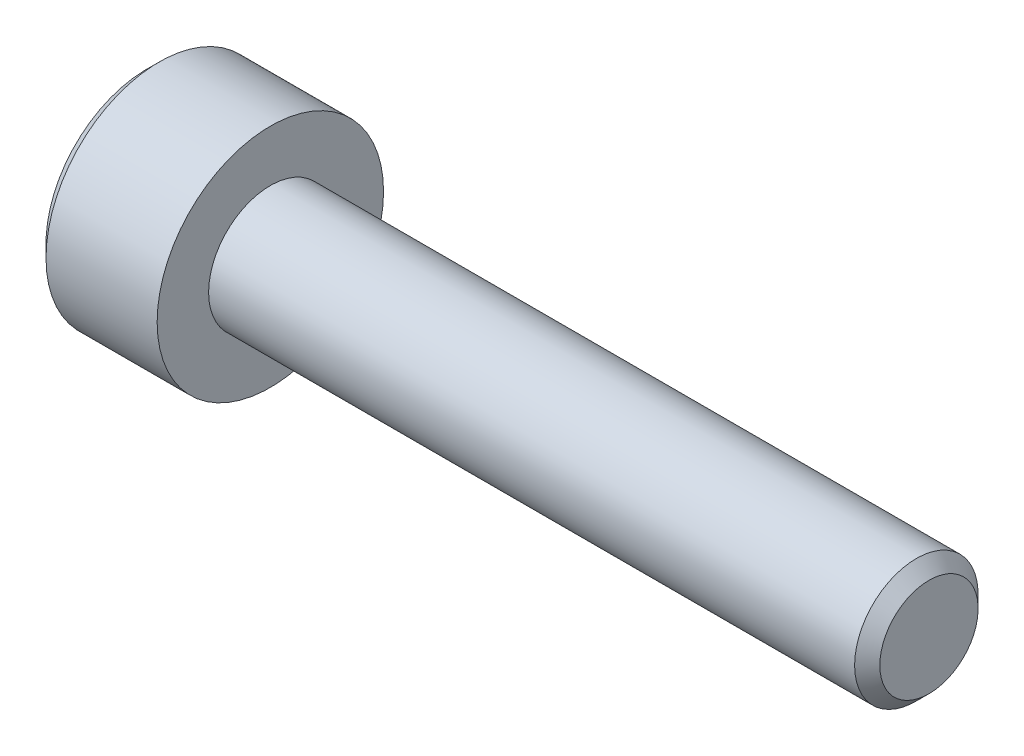
ISO-10303-21;
HEADER;
FILE_DESCRIPTION(('STEP AP214'),'2;1');
FILE_NAME('part.step','',(''),(''),'','','');
FILE_SCHEMA(('AUTOMOTIVE_DESIGN { 1 0 10303 214 1 1 1 1 }'));
ENDSEC;
DATA;
#1=APPLICATION_CONTEXT('core data for automotive mechanical design processes');
#2=APPLICATION_PROTOCOL_DEFINITION('international standard','automotive_design',2000,#1);
#3=PRODUCT_CONTEXT('',#1,'mechanical');
#4=PRODUCT('Part','Part','',(#3));
#5=PRODUCT_RELATED_PRODUCT_CATEGORY('part','',(#4));
#6=PRODUCT_DEFINITION_FORMATION('','',#4);
#7=PRODUCT_DEFINITION_CONTEXT('part definition',#1,'design');
#8=PRODUCT_DEFINITION('design','',#6,#7);
#9=PRODUCT_DEFINITION_SHAPE('','',#8);
#10=(LENGTH_UNIT() NAMED_UNIT(*) SI_UNIT(.MILLI.,.METRE.));
#11=(NAMED_UNIT(*) PLANE_ANGLE_UNIT() SI_UNIT($,.RADIAN.));
#12=(NAMED_UNIT(*) SI_UNIT($,.STERADIAN.) SOLID_ANGLE_UNIT());
#13=UNCERTAINTY_MEASURE_WITH_UNIT(LENGTH_MEASURE(1.E-05),#10,'distance_accuracy_value','');
#14=(GEOMETRIC_REPRESENTATION_CONTEXT(3) GLOBAL_UNCERTAINTY_ASSIGNED_CONTEXT((#13)) GLOBAL_UNIT_ASSIGNED_CONTEXT((#10,
#11,#12)) REPRESENTATION_CONTEXT('',''));
#15=CARTESIAN_POINT('',(0.,0.,0.));
#16=DIRECTION('',(0.,0.,1.));
#17=DIRECTION('',(1.,0.,0.));
#18=AXIS2_PLACEMENT_3D('',#15,#16,#17);
#19=CARTESIAN_POINT('',(-1.49999999999295,0.,0.));
#20=DIRECTION('',(-1.,0.,0.));
#21=DIRECTION('',(0.,0.,1.));
#22=AXIS2_PLACEMENT_3D('',#19,#20,#21);
#23=CONICAL_SURFACE('',#22,1.24999999997044,1.30899693901632);
#24=CARTESIAN_POINT('',(-1.16506350948953,0.,0.));
#25=VERTEX_POINT('',#24);
#26=VERTEX_LOOP('',#25);
#27=FACE_BOUND('',#26,.T.);
#28=CARTESIAN_POINT('',(-1.49999999999295,0.,0.));
#29=DIRECTION('',(-1.,0.,0.));
#30=DIRECTION('',(0.,0.,1.));
#31=AXIS2_PLACEMENT_3D('',#28,#29,#30);
#32=CIRCLE('',#31,1.24999999997044);
#33=CARTESIAN_POINT('',(-1.49999999999648,1.08253175471775,-0.624999999992609));
#34=VERTEX_POINT('',#33);
#35=CARTESIAN_POINT('',(-1.49999999999648,0.,-1.24999999998522));
#36=VERTEX_POINT('',#35);
#37=EDGE_CURVE('E152',#34,#36,#32,.T.);
#38=ORIENTED_EDGE('',*,*,#37,.T.);
#39=CARTESIAN_POINT('',(-1.49999999999295,0.,0.));
#40=DIRECTION('',(-1.,0.,0.));
#41=DIRECTION('',(0.,0.,1.));
#42=AXIS2_PLACEMENT_3D('',#39,#40,#41);
#43=CIRCLE('',#42,1.24999999997044);
#44=CARTESIAN_POINT('',(-1.49999999999648,-1.08253175471775,-0.624999999992609));
#45=VERTEX_POINT('',#44);
#46=EDGE_CURVE('E136',#36,#45,#43,.T.);
#47=ORIENTED_EDGE('',*,*,#46,.T.);
#48=CARTESIAN_POINT('',(-1.49999999999295,0.,0.));
#49=DIRECTION('',(-1.,0.,0.));
#50=DIRECTION('',(0.,0.,1.));
#51=AXIS2_PLACEMENT_3D('',#48,#49,#50);
#52=CIRCLE('',#51,1.24999999997044);
#53=CARTESIAN_POINT('',(-1.49999999999648,-1.08253175471775,0.624999999992609));
#54=VERTEX_POINT('',#53);
#55=EDGE_CURVE('E89',#45,#54,#52,.T.);
#56=ORIENTED_EDGE('',*,*,#55,.T.);
#57=CARTESIAN_POINT('',(-1.49999999999295,0.,0.));
#58=DIRECTION('',(-1.,0.,0.));
#59=DIRECTION('',(0.,0.,1.));
#60=AXIS2_PLACEMENT_3D('',#57,#58,#59);
#61=CIRCLE('',#60,1.24999999997044);
#62=CARTESIAN_POINT('',(-1.49999999999648,0.,1.24999999998522));
#63=VERTEX_POINT('',#62);
#64=EDGE_CURVE('E20',#54,#63,#61,.T.);
#65=ORIENTED_EDGE('',*,*,#64,.T.);
#66=CARTESIAN_POINT('',(-1.49999999999295,0.,0.));
#67=DIRECTION('',(-1.,0.,0.));
#68=DIRECTION('',(0.,0.,1.));
#69=AXIS2_PLACEMENT_3D('',#66,#67,#68);
#70=CIRCLE('',#69,1.24999999997044);
#71=CARTESIAN_POINT('',(-1.49999999999648,1.08253175471775,0.624999999992609));
#72=VERTEX_POINT('',#71);
#73=EDGE_CURVE('E92',#63,#72,#70,.T.);
#74=ORIENTED_EDGE('',*,*,#73,.T.);
#75=CARTESIAN_POINT('',(-1.49999999999295,0.,0.));
#76=DIRECTION('',(-1.,0.,0.));
#77=DIRECTION('',(0.,0.,1.));
#78=AXIS2_PLACEMENT_3D('',#75,#76,#77);
#79=CIRCLE('',#78,1.24999999997044);
#80=EDGE_CURVE('E106',#72,#34,#79,.T.);
#81=ORIENTED_EDGE('',*,*,#80,.T.);
#82=EDGE_LOOP('',(#38,#47,#56,#65,#74,#81));
#83=FACE_BOUND('',#82,.T.);
#84=ADVANCED_FACE('F17',(#27,#83),#23,.F.);
#85=CARTESIAN_POINT('',(-1.5,0.,0.));
#86=DIRECTION('',(1.,0.,0.));
#87=DIRECTION('',(0.,0.,-1.));
#88=AXIS2_PLACEMENT_3D('',#85,#86,#87);
#89=PLANE('',#88);
#90=DIRECTION('',(0.,0.5,0.866025403784439));
#91=VECTOR('',#90,1.);
#92=CARTESIAN_POINT('',(-1.5,-0.721687836487032,1.25));
#93=LINE('',#92,#91);
#94=CARTESIAN_POINT('',(-1.5,-0.721687836487032,1.25));
#95=VERTEX_POINT('',#94);
#96=EDGE_CURVE('E111',#95,#54,#93,.F.);
#97=ORIENTED_EDGE('',*,*,#96,.F.);
#98=DIRECTION('',(0.,1.,0.));
#99=VECTOR('',#98,1.);
#100=CARTESIAN_POINT('',(-1.5,0.721687836487032,1.25));
#101=LINE('',#100,#99);
#102=EDGE_CURVE('E108',#63,#95,#101,.F.);
#103=ORIENTED_EDGE('',*,*,#102,.F.);
#104=ORIENTED_EDGE('',*,*,#64,.F.);
#105=EDGE_LOOP('',(#97,#103,#104));
#106=FACE_BOUND('',#105,.T.);
#107=ADVANCED_FACE('F109',(#106),#89,.F.);
#108=CARTESIAN_POINT('',(-1.5,0.,0.));
#109=DIRECTION('',(1.,0.,0.));
#110=DIRECTION('',(0.,0.,-1.));
#111=AXIS2_PLACEMENT_3D('',#108,#109,#110);
#112=PLANE('',#111);
#113=DIRECTION('',(0.,1.,0.));
#114=VECTOR('',#113,1.);
#115=CARTESIAN_POINT('',(-1.5,0.721687836487032,1.25));
#116=LINE('',#115,#114);
#117=CARTESIAN_POINT('',(-1.5,0.721687836487029,1.25));
#118=VERTEX_POINT('',#117);
#119=EDGE_CURVE('E101',#118,#63,#116,.F.);
#120=ORIENTED_EDGE('',*,*,#119,.F.);
#121=DIRECTION('',(0.,0.5,-0.866025403784439));
#122=VECTOR('',#121,1.);
#123=CARTESIAN_POINT('',(-1.5,1.44337567297406,0.));
#124=LINE('',#123,#122);
#125=EDGE_CURVE('E104',#72,#118,#124,.F.);
#126=ORIENTED_EDGE('',*,*,#125,.F.);
#127=ORIENTED_EDGE('',*,*,#73,.F.);
#128=EDGE_LOOP('',(#120,#126,#127));
#129=FACE_BOUND('',#128,.T.);
#130=ADVANCED_FACE('F99',(#129),#112,.F.);
#131=CARTESIAN_POINT('',(-1.5,0.,0.));
#132=DIRECTION('',(1.,0.,0.));
#133=DIRECTION('',(0.,0.,-1.));
#134=AXIS2_PLACEMENT_3D('',#131,#132,#133);
#135=PLANE('',#134);
#136=ORIENTED_EDGE('',*,*,#80,.F.);
#137=DIRECTION('',(0.,0.5,-0.866025403784439));
#138=VECTOR('',#137,1.);
#139=CARTESIAN_POINT('',(-1.5,1.44337567297406,0.));
#140=LINE('',#139,#138);
#141=CARTESIAN_POINT('',(-1.5,1.44337567297406,0.));
#142=VERTEX_POINT('',#141);
#143=EDGE_CURVE('E132',#142,#72,#140,.F.);
#144=ORIENTED_EDGE('',*,*,#143,.F.);
#145=DIRECTION('',(0.,-0.5,-0.866025403784439));
#146=VECTOR('',#145,1.);
#147=CARTESIAN_POINT('',(-1.5,0.721687836487032,-1.25));
#148=LINE('',#147,#146);
#149=EDGE_CURVE('E168',#34,#142,#148,.F.);
#150=ORIENTED_EDGE('',*,*,#149,.F.);
#151=EDGE_LOOP('',(#136,#144,#150));
#152=FACE_BOUND('',#151,.T.);
#153=ADVANCED_FACE('F169',(#152),#135,.F.);
#154=CARTESIAN_POINT('',(-1.5,0.,0.));
#155=DIRECTION('',(1.,0.,0.));
#156=DIRECTION('',(0.,0.,-1.));
#157=AXIS2_PLACEMENT_3D('',#154,#155,#156);
#158=PLANE('',#157);
#159=DIRECTION('',(0.,-0.5,-0.866025403784439));
#160=VECTOR('',#159,1.);
#161=CARTESIAN_POINT('',(-1.5,0.721687836487032,-1.25));
#162=LINE('',#161,#160);
#163=CARTESIAN_POINT('',(-1.5,0.721687836487032,-1.25));
#164=VERTEX_POINT('',#163);
#165=EDGE_CURVE('E162',#164,#34,#162,.F.);
#166=ORIENTED_EDGE('',*,*,#165,.F.);
#167=DIRECTION('',(0.,1.,0.));
#168=VECTOR('',#167,1.);
#169=CARTESIAN_POINT('',(-1.5,-0.721687836487032,-1.25));
#170=LINE('',#169,#168);
#171=EDGE_CURVE('E165',#36,#164,#170,.T.);
#172=ORIENTED_EDGE('',*,*,#171,.F.);
#173=ORIENTED_EDGE('',*,*,#37,.F.);
#174=EDGE_LOOP('',(#166,#172,#173));
#175=FACE_BOUND('',#174,.T.);
#176=ADVANCED_FACE('F160',(#175),#158,.F.);
#177=CARTESIAN_POINT('',(-1.5,0.,0.));
#178=DIRECTION('',(1.,0.,0.));
#179=DIRECTION('',(0.,0.,-1.));
#180=AXIS2_PLACEMENT_3D('',#177,#178,#179);
#181=PLANE('',#180);
#182=DIRECTION('',(0.,-0.5,0.866025403784439));
#183=VECTOR('',#182,1.);
#184=CARTESIAN_POINT('',(-1.5,-1.44337567297406,0.));
#185=LINE('',#184,#183);
#186=CARTESIAN_POINT('',(-1.5,-1.44337567297406,0.));
#187=VERTEX_POINT('',#186);
#188=EDGE_CURVE('E214',#187,#45,#185,.F.);
#189=ORIENTED_EDGE('',*,*,#188,.F.);
#190=DIRECTION('',(0.,0.5,0.866025403784439));
#191=VECTOR('',#190,1.);
#192=CARTESIAN_POINT('',(-1.5,-0.721687836487032,1.25));
#193=LINE('',#192,#191);
#194=EDGE_CURVE('E120',#54,#187,#193,.F.);
#195=ORIENTED_EDGE('',*,*,#194,.F.);
#196=ORIENTED_EDGE('',*,*,#55,.F.);
#197=EDGE_LOOP('',(#189,#195,#196));
#198=FACE_BOUND('',#197,.T.);
#199=ADVANCED_FACE('F253',(#198),#181,.F.);
#200=CARTESIAN_POINT('',(-1.5,0.,0.));
#201=DIRECTION('',(1.,0.,0.));
#202=DIRECTION('',(0.,0.,-1.));
#203=AXIS2_PLACEMENT_3D('',#200,#201,#202);
#204=PLANE('',#203);
#205=DIRECTION('',(0.,1.,0.));
#206=VECTOR('',#205,1.);
#207=CARTESIAN_POINT('',(-1.5,-0.721687836487032,-1.25));
#208=LINE('',#207,#206);
#209=CARTESIAN_POINT('',(-1.5,-0.721687836487029,-1.25));
#210=VERTEX_POINT('',#209);
#211=EDGE_CURVE('E187',#210,#36,#208,.T.);
#212=ORIENTED_EDGE('',*,*,#211,.F.);
#213=DIRECTION('',(0.,-0.5,0.866025403784439));
#214=VECTOR('',#213,1.);
#215=CARTESIAN_POINT('',(-1.5,-1.44337567297406,0.));
#216=LINE('',#215,#214);
#217=EDGE_CURVE('E217',#45,#210,#216,.F.);
#218=ORIENTED_EDGE('',*,*,#217,.F.);
#219=ORIENTED_EDGE('',*,*,#46,.F.);
#220=EDGE_LOOP('',(#212,#218,#219));
#221=FACE_BOUND('',#220,.T.);
#222=ADVANCED_FACE('F250',(#221),#204,.F.);
#223=CARTESIAN_POINT('',(-1.5,-0.721687836487032,1.25));
#224=DIRECTION('',(0.,0.866025403784439,-0.5));
#225=DIRECTION('',(0.,0.5,0.866025403784439));
#226=AXIS2_PLACEMENT_3D('',#223,#224,#225);
#227=PLANE('',#226);
#228=ORIENTED_EDGE('',*,*,#194,.T.);
#229=DIRECTION('',(1.,0.,0.));
#230=VECTOR('',#229,1.);
#231=CARTESIAN_POINT('',(-1.5,-1.44337567297406,0.));
#232=LINE('',#231,#230);
#233=CARTESIAN_POINT('',(-3.,-1.44337567297406,0.));
#234=VERTEX_POINT('',#233);
#235=EDGE_CURVE('E218',#234,#187,#232,.T.);
#236=ORIENTED_EDGE('',*,*,#235,.F.);
#237=DIRECTION('',(0.,0.499999999999998,0.86602540378444));
#238=VECTOR('',#237,1.);
#239=CARTESIAN_POINT('',(-3.,-1.44337567297406,0.));
#240=LINE('',#239,#238);
#241=CARTESIAN_POINT('',(-3.,-0.721687836487032,1.25));
#242=VERTEX_POINT('',#241);
#243=EDGE_CURVE('E213',#234,#242,#240,.T.);
#244=ORIENTED_EDGE('',*,*,#243,.T.);
#245=DIRECTION('',(-1.,0.,0.));
#246=VECTOR('',#245,1.);
#247=CARTESIAN_POINT('',(-1.5,-0.721687836487032,1.25));
#248=LINE('',#247,#246);
#249=EDGE_CURVE('E115',#95,#242,#248,.T.);
#250=ORIENTED_EDGE('',*,*,#249,.F.);
#251=ORIENTED_EDGE('',*,*,#96,.T.);
#252=EDGE_LOOP('',(#228,#236,#244,#250,#251));
#253=FACE_BOUND('',#252,.T.);
#254=ADVANCED_FACE('F255',(#253),#227,.T.);
#255=CARTESIAN_POINT('',(-1.5,0.721687836487032,1.25));
#256=DIRECTION('',(0.,0.,-1.));
#257=DIRECTION('',(-1.,0.,0.));
#258=AXIS2_PLACEMENT_3D('',#255,#256,#257);
#259=PLANE('',#258);
#260=ORIENTED_EDGE('',*,*,#102,.T.);
#261=ORIENTED_EDGE('',*,*,#249,.T.);
#262=DIRECTION('',(0.,1.,0.));
#263=VECTOR('',#262,1.);
#264=CARTESIAN_POINT('',(-3.,0.,1.25));
#265=LINE('',#264,#263);
#266=CARTESIAN_POINT('',(-3.,0.721687836487031,1.25));
#267=VERTEX_POINT('',#266);
#268=EDGE_CURVE('E208',#242,#267,#265,.T.);
#269=ORIENTED_EDGE('',*,*,#268,.T.);
#270=DIRECTION('',(1.,0.,0.));
#271=VECTOR('',#270,1.);
#272=CARTESIAN_POINT('',(-1.5,0.721687836487029,1.25));
#273=LINE('',#272,#271);
#274=EDGE_CURVE('E119',#118,#267,#273,.F.);
#275=ORIENTED_EDGE('',*,*,#274,.F.);
#276=ORIENTED_EDGE('',*,*,#119,.T.);
#277=EDGE_LOOP('',(#260,#261,#269,#275,#276));
#278=FACE_BOUND('',#277,.T.);
#279=ADVANCED_FACE('F117',(#278),#259,.T.);
#280=CARTESIAN_POINT('',(-1.5,1.44337567297406,0.));
#281=DIRECTION('',(0.,-0.866025403784439,-0.5));
#282=DIRECTION('',(0.,0.5,-0.866025403784439));
#283=AXIS2_PLACEMENT_3D('',#280,#281,#282);
#284=PLANE('',#283);
#285=ORIENTED_EDGE('',*,*,#125,.T.);
#286=ORIENTED_EDGE('',*,*,#274,.T.);
#287=DIRECTION('',(0.,0.499999999999998,-0.86602540378444));
#288=VECTOR('',#287,1.);
#289=CARTESIAN_POINT('',(-3.,0.721687836487032,1.25));
#290=LINE('',#289,#288);
#291=CARTESIAN_POINT('',(-3.,1.44337567297406,0.));
#292=VERTEX_POINT('',#291);
#293=EDGE_CURVE('E198',#267,#292,#290,.T.);
#294=ORIENTED_EDGE('',*,*,#293,.T.);
#295=DIRECTION('',(1.,0.,0.));
#296=VECTOR('',#295,1.);
#297=CARTESIAN_POINT('',(-1.5,1.44337567297406,0.));
#298=LINE('',#297,#296);
#299=EDGE_CURVE('E173',#142,#292,#298,.F.);
#300=ORIENTED_EDGE('',*,*,#299,.F.);
#301=ORIENTED_EDGE('',*,*,#143,.T.);
#302=EDGE_LOOP('',(#285,#286,#294,#300,#301));
#303=FACE_BOUND('',#302,.T.);
#304=ADVANCED_FACE('F196',(#303),#284,.T.);
#305=CARTESIAN_POINT('',(-1.5,0.721687836487032,-1.25));
#306=DIRECTION('',(0.,-0.866025403784439,0.5));
#307=DIRECTION('',(0.,-0.5,-0.866025403784439));
#308=AXIS2_PLACEMENT_3D('',#305,#306,#307);
#309=PLANE('',#308);
#310=ORIENTED_EDGE('',*,*,#149,.T.);
#311=ORIENTED_EDGE('',*,*,#299,.T.);
#312=DIRECTION('',(0.,-0.499999999999998,-0.86602540378444));
#313=VECTOR('',#312,1.);
#314=CARTESIAN_POINT('',(-3.,1.44337567297406,0.));
#315=LINE('',#314,#313);
#316=CARTESIAN_POINT('',(-3.,0.721687836487032,-1.25));
#317=VERTEX_POINT('',#316);
#318=EDGE_CURVE('E200',#292,#317,#315,.T.);
#319=ORIENTED_EDGE('',*,*,#318,.T.);
#320=DIRECTION('',(1.,0.,0.));
#321=VECTOR('',#320,1.);
#322=CARTESIAN_POINT('',(-1.5,0.721687836487032,-1.25));
#323=LINE('',#322,#321);
#324=EDGE_CURVE('E176',#164,#317,#323,.F.);
#325=ORIENTED_EDGE('',*,*,#324,.F.);
#326=ORIENTED_EDGE('',*,*,#165,.T.);
#327=EDGE_LOOP('',(#310,#311,#319,#325,#326));
#328=FACE_BOUND('',#327,.T.);
#329=ADVANCED_FACE('F175',(#328),#309,.T.);
#330=CARTESIAN_POINT('',(-1.5,-0.721687836487032,-1.25));
#331=DIRECTION('',(0.,0.,1.));
#332=DIRECTION('',(1.,0.,0.));
#333=AXIS2_PLACEMENT_3D('',#330,#331,#332);
#334=PLANE('',#333);
#335=ORIENTED_EDGE('',*,*,#171,.T.);
#336=ORIENTED_EDGE('',*,*,#324,.T.);
#337=DIRECTION('',(0.,1.,0.));
#338=VECTOR('',#337,1.);
#339=CARTESIAN_POINT('',(-3.,0.,-1.25));
#340=LINE('',#339,#338);
#341=CARTESIAN_POINT('',(-3.,-0.721687836487031,-1.25));
#342=VERTEX_POINT('',#341);
#343=EDGE_CURVE('E35',#317,#342,#340,.F.);
#344=ORIENTED_EDGE('',*,*,#343,.T.);
#345=DIRECTION('',(1.,0.,0.));
#346=VECTOR('',#345,1.);
#347=CARTESIAN_POINT('',(-1.5,-0.721687836487029,-1.25));
#348=LINE('',#347,#346);
#349=EDGE_CURVE('E223',#210,#342,#348,.F.);
#350=ORIENTED_EDGE('',*,*,#349,.F.);
#351=ORIENTED_EDGE('',*,*,#211,.T.);
#352=EDGE_LOOP('',(#335,#336,#344,#350,#351));
#353=FACE_BOUND('',#352,.T.);
#354=ADVANCED_FACE('F247',(#353),#334,.T.);
#355=CARTESIAN_POINT('',(-1.5,-1.44337567297406,0.));
#356=DIRECTION('',(0.,0.866025403784439,0.5));
#357=DIRECTION('',(0.,-0.5,0.866025403784439));
#358=AXIS2_PLACEMENT_3D('',#355,#356,#357);
#359=PLANE('',#358);
#360=ORIENTED_EDGE('',*,*,#217,.T.);
#361=ORIENTED_EDGE('',*,*,#349,.T.);
#362=DIRECTION('',(0.,-0.499999999999998,0.86602540378444));
#363=VECTOR('',#362,1.);
#364=CARTESIAN_POINT('',(-3.,-0.721687836487032,-1.25));
#365=LINE('',#364,#363);
#366=EDGE_CURVE('E149',#342,#234,#365,.T.);
#367=ORIENTED_EDGE('',*,*,#366,.T.);
#368=ORIENTED_EDGE('',*,*,#235,.T.);
#369=ORIENTED_EDGE('',*,*,#188,.T.);
#370=EDGE_LOOP('',(#360,#361,#367,#368,#369));
#371=FACE_BOUND('',#370,.T.);
#372=ADVANCED_FACE('F258',(#371),#359,.T.);
#373=CARTESIAN_POINT('',(-3.,0.,0.));
#374=DIRECTION('',(1.,0.,0.));
#375=DIRECTION('',(0.,0.,-1.));
#376=AXIS2_PLACEMENT_3D('',#373,#374,#375);
#377=PLANE('',#376);
#378=ORIENTED_EDGE('',*,*,#343,.F.);
#379=ORIENTED_EDGE('',*,*,#318,.F.);
#380=ORIENTED_EDGE('',*,*,#293,.F.);
#381=ORIENTED_EDGE('',*,*,#268,.F.);
#382=ORIENTED_EDGE('',*,*,#243,.F.);
#383=ORIENTED_EDGE('',*,*,#366,.F.);
#384=EDGE_LOOP('',(#378,#379,#380,#381,#382,#383));
#385=FACE_BOUND('',#384,.T.);
#386=CARTESIAN_POINT('',(-2.9999999999859,0.,0.));
#387=DIRECTION('',(1.,0.,0.));
#388=DIRECTION('',(0.,0.,-1.));
#389=AXIS2_PLACEMENT_3D('',#386,#387,#388);
#390=CIRCLE('',#389,2.45000000006712);
#391=CARTESIAN_POINT('',(-2.9999999999859,0.,-2.45000000006712));
#392=VERTEX_POINT('',#391);
#393=EDGE_CURVE('E146',#392,#392,#390,.T.);
#394=ORIENTED_EDGE('',*,*,#393,.F.);
#395=EDGE_LOOP('',(#394));
#396=FACE_BOUND('',#395,.T.);
#397=ADVANCED_FACE('F202',(#385,#396),#377,.F.);
#398=CARTESIAN_POINT('',(-2.70000000000437,0.,0.));
#399=DIRECTION('',(1.,0.,0.));
#400=DIRECTION('',(0.,0.,-1.));
#401=AXIS2_PLACEMENT_3D('',#398,#399,#400);
#402=CONICAL_SURFACE('',#401,2.75000000004866,0.785398163397448);
#403=ORIENTED_EDGE('',*,*,#393,.T.);
#404=EDGE_LOOP('',(#403));
#405=FACE_BOUND('',#404,.T.);
#406=CARTESIAN_POINT('',(-2.7,0.,0.));
#407=DIRECTION('',(-1.,0.,0.));
#408=DIRECTION('',(0.,0.,1.));
#409=AXIS2_PLACEMENT_3D('',#406,#407,#408);
#410=CIRCLE('',#409,2.75);
#411=CARTESIAN_POINT('',(-2.7,0.,2.75));
#412=VERTEX_POINT('',#411);
#413=EDGE_CURVE('E145',#412,#412,#410,.F.);
#414=ORIENTED_EDGE('',*,*,#413,.F.);
#415=EDGE_LOOP('',(#414));
#416=FACE_BOUND('',#415,.T.);
#417=ADVANCED_FACE('F266',(#405,#416),#402,.T.);
#418=CARTESIAN_POINT('',(16.,1.1935,0.));
#419=DIRECTION('',(-1.,0.,0.));
#420=DIRECTION('',(0.,0.,1.));
#421=AXIS2_PLACEMENT_3D('',#418,#419,#420);
#422=PLANE('',#421);
#423=CARTESIAN_POINT('',(16.0000000000196,0.,0.));
#424=DIRECTION('',(-1.,0.,0.));
#425=DIRECTION('',(0.,0.,1.));
#426=AXIS2_PLACEMENT_3D('',#423,#424,#425);
#427=CIRCLE('',#426,1.1934999999994);
#428=CARTESIAN_POINT('',(16.0000000000196,0.,1.1934999999994));
#429=VERTEX_POINT('',#428);
#430=EDGE_CURVE('E142',#429,#429,#427,.T.);
#431=ORIENTED_EDGE('',*,*,#430,.F.);
#432=EDGE_LOOP('',(#431));
#433=FACE_BOUND('',#432,.T.);
#434=ADVANCED_FACE('F288',(#433),#422,.F.);
#435=CARTESIAN_POINT('',(16.,0.,0.));
#436=DIRECTION('',(-1.,0.,0.));
#437=DIRECTION('',(0.,0.,1.));
#438=AXIS2_PLACEMENT_3D('',#435,#436,#437);
#439=CYLINDRICAL_SURFACE('',#438,2.75);
#440=ORIENTED_EDGE('',*,*,#413,.T.);
#441=EDGE_LOOP('',(#440));
#442=FACE_BOUND('',#441,.T.);
#443=CARTESIAN_POINT('',(0.,0.,0.));
#444=DIRECTION('',(-1.,0.,0.));
#445=DIRECTION('',(0.,0.,1.));
#446=AXIS2_PLACEMENT_3D('',#443,#444,#445);
#447=CIRCLE('',#446,2.75);
#448=CARTESIAN_POINT('',(0.,0.,2.75));
#449=VERTEX_POINT('',#448);
#450=EDGE_CURVE('E139',#449,#449,#447,.T.);
#451=ORIENTED_EDGE('',*,*,#450,.T.);
#452=EDGE_LOOP('',(#451));
#453=FACE_BOUND('',#452,.T.);
#454=ADVANCED_FACE('F284',(#442,#453),#439,.T.);
#455=CARTESIAN_POINT('',(15.6934999998839,0.,0.));
#456=DIRECTION('',(-1.,0.,0.));
#457=DIRECTION('',(0.,0.,1.));
#458=AXIS2_PLACEMENT_3D('',#455,#456,#457);
#459=CONICAL_SURFACE('',#458,1.50000000007822,0.785398163304718);
#460=CARTESIAN_POINT('',(15.6935,0.,0.));
#461=DIRECTION('',(-1.,0.,0.));
#462=DIRECTION('',(0.,0.,1.));
#463=AXIS2_PLACEMENT_3D('',#460,#461,#462);
#464=CIRCLE('',#463,1.5);
#465=CARTESIAN_POINT('',(15.6935,0.,1.5));
#466=VERTEX_POINT('',#465);
#467=EDGE_CURVE('E26',#466,#466,#464,.T.);
#468=ORIENTED_EDGE('',*,*,#467,.F.);
#469=EDGE_LOOP('',(#468));
#470=FACE_BOUND('',#469,.T.);
#471=ORIENTED_EDGE('',*,*,#430,.T.);
#472=EDGE_LOOP('',(#471));
#473=FACE_BOUND('',#472,.T.);
#474=ADVANCED_FACE('F277',(#470,#473),#459,.T.);
#475=CARTESIAN_POINT('',(0.,2.75,0.));
#476=DIRECTION('',(-1.,0.,0.));
#477=DIRECTION('',(0.,0.,1.));
#478=AXIS2_PLACEMENT_3D('',#475,#476,#477);
#479=PLANE('',#478);
#480=ORIENTED_EDGE('',*,*,#450,.F.);
#481=EDGE_LOOP('',(#480));
#482=FACE_BOUND('',#481,.T.);
#483=CARTESIAN_POINT('',(0.,0.,0.));
#484=DIRECTION('',(-1.,0.,0.));
#485=DIRECTION('',(0.,0.,1.));
#486=AXIS2_PLACEMENT_3D('',#483,#484,#485);
#487=CIRCLE('',#486,1.5);
#488=CARTESIAN_POINT('',(0.,0.,1.5));
#489=VERTEX_POINT('',#488);
#490=EDGE_CURVE('E11',#489,#489,#487,.F.);
#491=ORIENTED_EDGE('',*,*,#490,.F.);
#492=EDGE_LOOP('',(#491));
#493=FACE_BOUND('',#492,.T.);
#494=ADVANCED_FACE('F271',(#482,#493),#479,.F.);
#495=CARTESIAN_POINT('',(16.,0.,0.));
#496=DIRECTION('',(-1.,0.,0.));
#497=DIRECTION('',(0.,0.,1.));
#498=AXIS2_PLACEMENT_3D('',#495,#496,#497);
#499=CYLINDRICAL_SURFACE('',#498,1.5);
#500=ORIENTED_EDGE('',*,*,#490,.T.);
#501=EDGE_LOOP('',(#500));
#502=FACE_BOUND('',#501,.T.);
#503=ORIENTED_EDGE('',*,*,#467,.T.);
#504=EDGE_LOOP('',(#503));
#505=FACE_BOUND('',#504,.T.);
#506=ADVANCED_FACE('F269',(#502,#505),#499,.T.);
#507=CLOSED_SHELL('',(#84,#107,#130,#153,#176,#199,#222,#254,#279,#304,#329,#354,#372,#397,#417,
#434,#454,#474,#494,#506));
#508=MANIFOLD_SOLID_BREP('B1',#507);
#509=ADVANCED_BREP_SHAPE_REPRESENTATION('',(#18,#508),#14);
#510=SHAPE_DEFINITION_REPRESENTATION(#9,#509);
ENDSEC;
END-ISO-10303-21;
